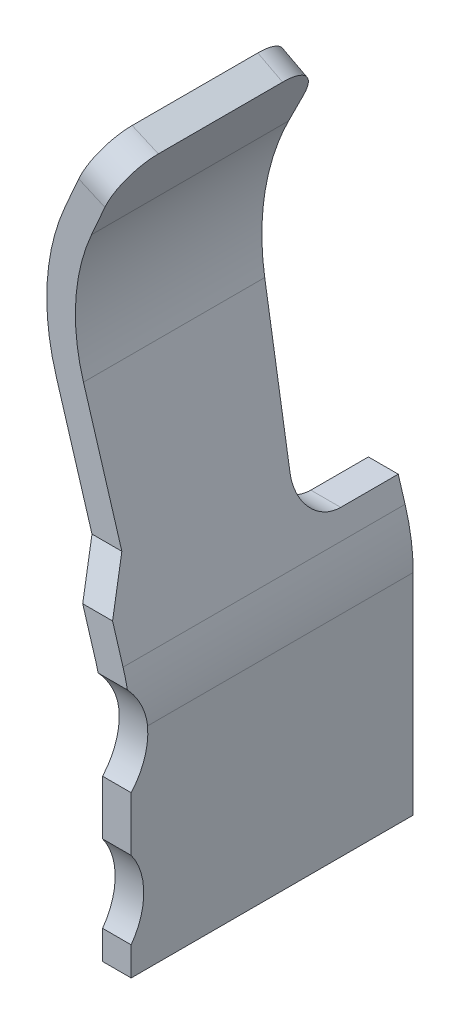
ISO-10303-21;
HEADER;
FILE_DESCRIPTION(('STEP AP214'),'2;1');
FILE_NAME('part.step','',(''),(''),'','','');
FILE_SCHEMA(('AUTOMOTIVE_DESIGN { 1 0 10303 214 1 1 1 1 }'));
ENDSEC;
DATA;
#1=APPLICATION_CONTEXT('core data for automotive mechanical design processes');
#2=APPLICATION_PROTOCOL_DEFINITION('international standard','automotive_design',2000,#1);
#3=PRODUCT_CONTEXT('',#1,'mechanical');
#4=PRODUCT('Part','Part','',(#3));
#5=PRODUCT_RELATED_PRODUCT_CATEGORY('part','',(#4));
#6=PRODUCT_DEFINITION_FORMATION('','',#4);
#7=PRODUCT_DEFINITION_CONTEXT('part definition',#1,'design');
#8=PRODUCT_DEFINITION('design','',#6,#7);
#9=PRODUCT_DEFINITION_SHAPE('','',#8);
#10=(LENGTH_UNIT() NAMED_UNIT(*) SI_UNIT(.MILLI.,.METRE.));
#11=(NAMED_UNIT(*) PLANE_ANGLE_UNIT() SI_UNIT($,.RADIAN.));
#12=(NAMED_UNIT(*) SI_UNIT($,.STERADIAN.) SOLID_ANGLE_UNIT());
#13=UNCERTAINTY_MEASURE_WITH_UNIT(LENGTH_MEASURE(1.E-05),#10,'distance_accuracy_value','');
#14=(GEOMETRIC_REPRESENTATION_CONTEXT(3) GLOBAL_UNCERTAINTY_ASSIGNED_CONTEXT((#13)) GLOBAL_UNIT_ASSIGNED_CONTEXT((#10,
#11,#12)) REPRESENTATION_CONTEXT('',''));
#15=CARTESIAN_POINT('',(0.,0.,0.));
#16=DIRECTION('',(0.,0.,1.));
#17=DIRECTION('',(1.,0.,0.));
#18=AXIS2_PLACEMENT_3D('',#15,#16,#17);
#19=CARTESIAN_POINT('',(14.5784449331811,3.52330708865174,0.423604352914839));
#20=DIRECTION('',(0.915327071470026,-0.402711251685505,0.));
#21=DIRECTION('',(0.402711251685505,0.915327071470026,0.));
#22=AXIS2_PLACEMENT_3D('',#19,#20,#21);
#23=CYLINDRICAL_SURFACE('',#22,0.2);
#24=CARTESIAN_POINT('',(14.5784449331811,3.52330708865174,0.423604352914839));
#25=DIRECTION('',(-0.915327071470029,0.402711251685498,0.));
#26=DIRECTION('',(0.402711251685498,0.915327071470029,0.));
#27=AXIS2_PLACEMENT_3D('',#24,#25,#26);
#28=CIRCLE('',#27,0.2);
#29=CARTESIAN_POINT('',(14.5784449331811,3.52330708865174,0.623604352914839));
#30=VERTEX_POINT('',#29);
#31=CARTESIAN_POINT('',(14.6589871835182,3.70637250294574,0.423604352914839));
#32=VERTEX_POINT('',#31);
#33=EDGE_CURVE('E312',#30,#32,#28,.T.);
#34=ORIENTED_EDGE('',*,*,#33,.F.);
#35=DIRECTION('',(-0.915327071470027,0.402711251685503,0.));
#36=VECTOR('',#35,1.);
#37=CARTESIAN_POINT('',(-10.0315059297135,14.3508073613119,0.623604352914805));
#38=LINE('',#37,#36);
#39=CARTESIAN_POINT('',(14.7157439939016,3.46290040089891,0.623604352914839));
#40=VERTEX_POINT('',#39);
#41=EDGE_CURVE('E27',#40,#30,#38,.T.);
#42=ORIENTED_EDGE('',*,*,#41,.F.);
#43=CARTESIAN_POINT('',(14.7157439939016,3.46290040089891,0.423604352914839));
#44=DIRECTION('',(0.915327071470029,-0.402711251685498,0.));
#45=DIRECTION('',(-0.402711251685498,-0.915327071470029,0.));
#46=AXIS2_PLACEMENT_3D('',#43,#44,#45);
#47=CIRCLE('',#46,0.2);
#48=CARTESIAN_POINT('',(14.7962862442387,3.64596581519291,0.423604352914839));
#49=VERTEX_POINT('',#48);
#50=EDGE_CURVE('E512',#49,#40,#47,.T.);
#51=ORIENTED_EDGE('',*,*,#50,.F.);
#52=DIRECTION('',(0.915327071470027,-0.402711251685503,0.));
#53=VECTOR('',#52,1.);
#54=CARTESIAN_POINT('',(14.6589871835182,3.70637250294574,0.423604352914839));
#55=LINE('',#54,#53);
#56=EDGE_CURVE('E340',#32,#49,#55,.T.);
#57=ORIENTED_EDGE('',*,*,#56,.F.);
#58=EDGE_LOOP('',(#34,#42,#51,#57));
#59=FACE_BOUND('',#58,.T.);
#60=ADVANCED_FACE('F16',(#59),#23,.T.);
#61=CARTESIAN_POINT('',(14.55613725867,3.53312166947706,-0.236832722369337));
#62=DIRECTION('',(-0.914255270392897,0.402239697454475,-0.0483789866630451));
#63=DIRECTION('',(-0.402711251685505,-0.915327071470026,0.));
#64=AXIS2_PLACEMENT_3D('',#61,#62,#63);
#65=CYLINDRICAL_SURFACE('',#64,0.2);
#66=CARTESIAN_POINT('',(14.7069405380458,3.44289092405021,-0.427421697659668));
#67=CARTESIAN_POINT('',(14.7580174651924,3.55898426375477,-0.441384710680955));
#68=CARTESIAN_POINT('',(14.7962862442387,3.64596581519291,-0.356133634256614));
#69=CARTESIAN_POINT('',(14.7962862442387,3.64596581519291,-0.228386927890316));
#70=(BOUNDED_CURVE() B_SPLINE_CURVE(3,(#66,#67,#68,#69),.UNSPECIFIED.,.F.,
.F.) B_SPLINE_CURVE_WITH_KNOTS((4,4),(6.17366415670651,7.85398163397443),
.UNSPECIFIED.) CURVE() GEOMETRIC_REPRESENTATION_ITEM() RATIONAL_B_SPLINE_CURVE((1.,
0.778229742533869,0.778229742533869,1.)) REPRESENTATION_ITEM(''));
#71=CARTESIAN_POINT('',(14.7069405380458,3.44289092405021,-0.427421697659668));
#72=VERTEX_POINT('',#71);
#73=CARTESIAN_POINT('',(14.7962862442387,3.64596581519291,-0.228386927890316));
#74=VERTEX_POINT('',#73);
#75=EDGE_CURVE('E339',#72,#74,#70,.T.);
#76=ORIENTED_EDGE('',*,*,#75,.F.);
#77=DIRECTION('',(0.914255270392898,-0.402239697454473,0.0483789866630451));
#78=VECTOR('',#77,1.);
#79=CARTESIAN_POINT('',(-10.631852655037,14.5910558161891,-1.76825633941021));
#80=LINE('',#79,#78);
#81=CARTESIAN_POINT('',(14.5696414773253,3.50329761180303,-0.434687053017796));
#82=VERTEX_POINT('',#81);
#83=EDGE_CURVE('E11',#82,#72,#80,.T.);
#84=ORIENTED_EDGE('',*,*,#83,.F.);
#85=CARTESIAN_POINT('',(14.6589871835182,3.70637250294574,-0.235652283248443));
#86=CARTESIAN_POINT('',(14.6589871835182,3.70637250294574,-0.363398989614741));
#87=CARTESIAN_POINT('',(14.6207184044719,3.61939095150759,-0.448650066039082));
#88=CARTESIAN_POINT('',(14.5696414773253,3.50329761180303,-0.434687053017796));
#89=(BOUNDED_CURVE() B_SPLINE_CURVE(3,(#85,#86,#87,#88),.UNSPECIFIED.,.F.,
.F.) B_SPLINE_CURVE_WITH_KNOTS((4,4),(4.71238898038476,6.39270645765268),
.UNSPECIFIED.) CURVE() GEOMETRIC_REPRESENTATION_ITEM() RATIONAL_B_SPLINE_CURVE((1.,
0.778229742533871,0.778229742533871,1.)) REPRESENTATION_ITEM(''));
#90=CARTESIAN_POINT('',(14.6589871835182,3.70637250294574,-0.235652283248443));
#91=VERTEX_POINT('',#90);
#92=EDGE_CURVE('E542',#91,#82,#89,.T.);
#93=ORIENTED_EDGE('',*,*,#92,.F.);
#94=DIRECTION('',(-0.914255270392898,0.402239697454473,-0.0483789866630451));
#95=VECTOR('',#94,1.);
#96=CARTESIAN_POINT('',(14.6366795090071,3.71618708377106,-0.236832722369337));
#97=LINE('',#96,#95);
#98=EDGE_CURVE('E526',#74,#91,#97,.T.);
#99=ORIENTED_EDGE('',*,*,#98,.F.);
#100=EDGE_LOOP('',(#76,#84,#93,#99));
#101=FACE_BOUND('',#100,.T.);
#102=ADVANCED_FACE('F395',(#101),#65,.T.);
#103=CARTESIAN_POINT('',(-15.49,1.65634067151207,-0.212546111318104));
#104=DIRECTION('',(0.,-1.,0.));
#105=DIRECTION('',(0.,0.,-1.));
#106=AXIS2_PLACEMENT_3D('',#103,#104,#105);
#107=PLANE('',#106);
#108=DIRECTION('',(0.,0.,-1.));
#109=VECTOR('',#108,1.);
#110=CARTESIAN_POINT('',(14.7348350789415,1.65634067151207,-0.740000000000018));
#111=LINE('',#110,#109);
#112=CARTESIAN_POINT('',(14.7348350789415,1.65634067151207,-0.438042305987952));
#113=VERTEX_POINT('',#112);
#114=CARTESIAN_POINT('',(14.7348350789415,1.65634067151207,-0.740000000000018));
#115=VERTEX_POINT('',#114);
#116=EDGE_CURVE('E492',#113,#115,#111,.T.);
#117=ORIENTED_EDGE('',*,*,#116,.F.);
#118=DIRECTION('',(1.,0.,0.));
#119=VECTOR('',#118,1.);
#120=CARTESIAN_POINT('',(14.8915034091056,1.65634067151207,-0.438042305987951));
#121=LINE('',#120,#119);
#122=CARTESIAN_POINT('',(14.8915034091056,1.65634067151207,-0.438042305987951));
#123=VERTEX_POINT('',#122);
#124=EDGE_CURVE('E288',#113,#123,#121,.T.);
#125=ORIENTED_EDGE('',*,*,#124,.T.);
#126=DIRECTION('',(0.,0.,1.));
#127=VECTOR('',#126,1.);
#128=CARTESIAN_POINT('',(14.8915034091056,1.65634067151207,-0.740000000000018));
#129=LINE('',#128,#127);
#130=CARTESIAN_POINT('',(14.8915034091056,1.65634067151207,-0.740000000000018));
#131=VERTEX_POINT('',#130);
#132=EDGE_CURVE('E267',#131,#123,#129,.T.);
#133=ORIENTED_EDGE('',*,*,#132,.F.);
#134=DIRECTION('',(-1.,0.,0.));
#135=VECTOR('',#134,1.);
#136=CARTESIAN_POINT('',(13.97,1.65634067151207,-0.740000000000019));
#137=LINE('',#136,#135);
#138=EDGE_CURVE('E615',#131,#115,#137,.T.);
#139=ORIENTED_EDGE('',*,*,#138,.T.);
#140=EDGE_LOOP('',(#117,#125,#133,#139));
#141=FACE_BOUND('',#140,.T.);
#142=ADVANCED_FACE('F400',(#141),#107,.F.);
#143=CARTESIAN_POINT('',(-15.49,3.70637250294571,-0.459111687165995));
#144=DIRECTION('',(0.,0.119413416546905,0.992844618230162));
#145=DIRECTION('',(1.,0.,0.));
#146=AXIS2_PLACEMENT_3D('',#143,#144,#145);
#147=PLANE('',#146);
#148=DIRECTION('',(-0.28674853992682,0.951150986717314,-0.11439875574724));
#149=VECTOR('',#148,1.);
#150=CARTESIAN_POINT('',(14.9096639548885,1.59610175610151,-0.205300934614502));
#151=LINE('',#150,#149);
#152=CARTESIAN_POINT('',(14.8240083074336,1.88022335482146,-0.239473382341919));
#153=VERTEX_POINT('',#152);
#154=CARTESIAN_POINT('',(14.6034137359037,2.61194022573825,-0.327479914176621));
#155=VERTEX_POINT('',#154);
#156=EDGE_CURVE('E112',#153,#155,#151,.T.);
#157=ORIENTED_EDGE('',*,*,#156,.F.);
#158=DIRECTION('',(-1.,0.,0.));
#159=VECTOR('',#158,1.);
#160=CARTESIAN_POINT('',(14.7348350789415,1.88022335482146,-0.23947338234192));
#161=LINE('',#160,#159);
#162=CARTESIAN_POINT('',(14.6673399772696,1.88022335482146,-0.23947338234192));
#163=VERTEX_POINT('',#162);
#164=EDGE_CURVE('E260',#153,#163,#161,.T.);
#165=ORIENTED_EDGE('',*,*,#164,.T.);
#166=DIRECTION('',(0.286748539926818,-0.951150986717315,0.11439875574724));
#167=VECTOR('',#166,1.);
#168=CARTESIAN_POINT('',(14.7658776351119,1.55337185451571,-0.200161637444145));
#169=LINE('',#168,#167);
#170=CARTESIAN_POINT('',(14.4597982395462,2.56864369924933,-0.322272466749579));
#171=VERTEX_POINT('',#170);
#172=EDGE_CURVE('E490',#171,#163,#169,.T.);
#173=ORIENTED_EDGE('',*,*,#172,.F.);
#174=CARTESIAN_POINT('',(14.5082242460961,3.36370167510267,-0.417897288102545));
#175=CARTESIAN_POINT('',(14.3966992050933,3.11021511680704,-0.387409439934768));
#176=CARTESIAN_POINT('',(14.379862605404,2.83379189253285,-0.354162906673266));
#177=CARTESIAN_POINT('',(14.4597982395462,2.56864369924933,-0.322272466749579));
#178=(BOUNDED_CURVE() B_SPLINE_CURVE(3,(#174,#175,#176,#177),.UNSPECIFIED.,.F.,
.F.) B_SPLINE_CURVE_WITH_KNOTS((4,4),(4.29791199977039,5.00519872138853),
.UNSPECIFIED.) CURVE() GEOMETRIC_REPRESENTATION_ITEM() RATIONAL_B_SPLINE_CURVE((1.,
0.958744787021091,0.958744787021091,1.)) REPRESENTATION_ITEM(''));
#179=CARTESIAN_POINT('',(14.5082242460961,3.36370167510267,-0.417897288102545));
#180=VERTEX_POINT('',#179);
#181=EDGE_CURVE('E293',#180,#171,#178,.T.);
#182=ORIENTED_EDGE('',*,*,#181,.F.);
#183=DIRECTION('',(-0.400292818236851,-0.909830186054405,0.109428936813832));
#184=VECTOR('',#183,1.);
#185=CARTESIAN_POINT('',(14.5223335100882,3.39577078475993,-0.421754368938234));
#186=LINE('',#185,#184);
#187=EDGE_CURVE('E539',#82,#180,#186,.T.);
#188=ORIENTED_EDGE('',*,*,#187,.F.);
#189=ORIENTED_EDGE('',*,*,#83,.T.);
#190=DIRECTION('',(0.400292818236852,0.909830186054405,-0.109428936813832));
#191=VECTOR('',#190,1.);
#192=CARTESIAN_POINT('',(14.6599508196559,3.33608744850051,-0.414576013974332));
#193=LINE('',#192,#191);
#194=CARTESIAN_POINT('',(14.6455233068166,3.30329498734983,-0.410631932744417));
#195=VERTEX_POINT('',#194);
#196=EDGE_CURVE('E332',#195,#72,#193,.T.);
#197=ORIENTED_EDGE('',*,*,#196,.F.);
#198=CARTESIAN_POINT('',(14.6034137359037,2.61194022573825,-0.327479914176621));
#199=CARTESIAN_POINT('',(14.5339044888234,2.84250387207174,-0.355210731501565));
#200=CARTESIAN_POINT('',(14.5485450102924,3.08287189317973,-0.384120760424611));
#201=CARTESIAN_POINT('',(14.6455233068166,3.30329498734983,-0.410631932744417));
#202=(BOUNDED_CURVE() B_SPLINE_CURVE(3,(#198,#199,#200,#201),.UNSPECIFIED.,.F.,
.F.) B_SPLINE_CURVE_WITH_KNOTS((4,4),(1.27798658579106,1.98527330740919),
.UNSPECIFIED.) CURVE() GEOMETRIC_REPRESENTATION_ITEM() RATIONAL_B_SPLINE_CURVE((1.,
0.958744787021091,0.958744787021091,1.)) REPRESENTATION_ITEM(''));
#203=EDGE_CURVE('E263',#155,#195,#202,.T.);
#204=ORIENTED_EDGE('',*,*,#203,.F.);
#205=EDGE_LOOP('',(#157,#165,#173,#182,#188,#189,#197,#204));
#206=FACE_BOUND('',#205,.T.);
#207=ADVANCED_FACE('F258',(#206),#147,.F.);
#208=CARTESIAN_POINT('',(-15.49,1.94413292378283,0.623604352914797));
#209=DIRECTION('',(0.,0.,-1.));
#210=DIRECTION('',(0.,-1.,0.));
#211=AXIS2_PLACEMENT_3D('',#208,#209,#210);
#212=PLANE('',#211);
#213=DIRECTION('',(-0.402711251685501,-0.915327071470028,0.));
#214=VECTOR('',#213,1.);
#215=CARTESIAN_POINT('',(14.6455233068166,3.30329498734984,0.623604352914839));
#216=LINE('',#215,#214);
#217=CARTESIAN_POINT('',(14.6455233068166,3.30329498734984,0.623604352914839));
#218=VERTEX_POINT('',#217);
#219=EDGE_CURVE('E507',#40,#218,#216,.T.);
#220=ORIENTED_EDGE('',*,*,#219,.F.);
#221=ORIENTED_EDGE('',*,*,#41,.T.);
#222=DIRECTION('',(0.4027112516855,0.915327071470028,0.));
#223=VECTOR('',#222,1.);
#224=CARTESIAN_POINT('',(14.5082242460961,3.36370167510267,0.623604352914839));
#225=LINE('',#224,#223);
#226=CARTESIAN_POINT('',(14.5082242460961,3.36370167510267,0.623604352914839));
#227=VERTEX_POINT('',#226);
#228=EDGE_CURVE('E317',#227,#30,#225,.T.);
#229=ORIENTED_EDGE('',*,*,#228,.F.);
#230=CARTESIAN_POINT('',(15.5608503782866,2.90058373566433,0.62360435291484));
#231=DIRECTION('',(0.,0.,-1.));
#232=DIRECTION('',(-1.,0.,0.));
#233=AXIS2_PLACEMENT_3D('',#230,#231,#232);
#234=CIRCLE('',#233,1.15);
#235=CARTESIAN_POINT('',(14.4597982395462,2.56864369924933,0.623604352914839));
#236=VERTEX_POINT('',#235);
#237=EDGE_CURVE('E562',#236,#227,#234,.T.);
#238=ORIENTED_EDGE('',*,*,#237,.F.);
#239=DIRECTION('',(-0.288643509926088,0.957436642382956,0.));
#240=VECTOR('',#239,1.);
#241=CARTESIAN_POINT('',(14.7838211460255,1.49385284836845,0.623604352914839));
#242=LINE('',#241,#240);
#243=CARTESIAN_POINT('',(14.6480728200643,1.94413292378283,0.623604352914839));
#244=VERTEX_POINT('',#243);
#245=EDGE_CURVE('E587',#244,#236,#242,.T.);
#246=ORIENTED_EDGE('',*,*,#245,.F.);
#247=DIRECTION('',(1.,0.,0.));
#248=VECTOR('',#247,1.);
#249=CARTESIAN_POINT('',(-15.49,1.94413292378283,0.623604352914797));
#250=LINE('',#249,#248);
#251=CARTESIAN_POINT('',(14.8047411502284,1.94413292378283,0.623604352914839));
#252=VERTEX_POINT('',#251);
#253=EDGE_CURVE('E325',#244,#252,#250,.T.);
#254=ORIENTED_EDGE('',*,*,#253,.T.);
#255=DIRECTION('',(0.28864350992609,-0.957436642382956,0.));
#256=VECTOR('',#255,1.);
#257=CARTESIAN_POINT('',(14.927436642383,1.53714937485737,0.623604352914839));
#258=LINE('',#257,#256);
#259=CARTESIAN_POINT('',(14.6034137359037,2.61194022573825,0.623604352914839));
#260=VERTEX_POINT('',#259);
#261=EDGE_CURVE('E266',#260,#252,#258,.T.);
#262=ORIENTED_EDGE('',*,*,#261,.F.);
#263=CARTESIAN_POINT('',(15.5608503782866,2.90058373566433,0.62360435291484));
#264=DIRECTION('',(0.,0.,1.));
#265=DIRECTION('',(-1.,0.,0.));
#266=AXIS2_PLACEMENT_3D('',#263,#264,#265);
#267=CIRCLE('',#266,1.);
#268=EDGE_CURVE('E126',#218,#260,#267,.T.);
#269=ORIENTED_EDGE('',*,*,#268,.F.);
#270=EDGE_LOOP('',(#220,#221,#229,#238,#246,#254,#262,#269));
#271=FACE_BOUND('',#270,.T.);
#272=ADVANCED_FACE('F416',(#271),#212,.F.);
#273=CARTESIAN_POINT('',(-15.49,1.7003498353216,0.749999999999972));
#274=DIRECTION('',(0.,-0.460287319631494,-0.887770005906065));
#275=DIRECTION('',(0.,-0.887770005906065,0.460287319631494));
#276=AXIS2_PLACEMENT_3D('',#273,#274,#275);
#277=PLANE('',#276);
#278=DIRECTION('',(-1.,0.,0.));
#279=VECTOR('',#278,1.);
#280=CARTESIAN_POINT('',(13.97,1.7196371362757,0.739999999999981));
#281=LINE('',#280,#279);
#282=CARTESIAN_POINT('',(14.8724210876793,1.7196371362757,0.739999999999982));
#283=VERTEX_POINT('',#282);
#284=CARTESIAN_POINT('',(14.7157527575152,1.7196371362757,0.739999999999982));
#285=VERTEX_POINT('',#284);
#286=EDGE_CURVE('E498',#283,#285,#281,.T.);
#287=ORIENTED_EDGE('',*,*,#286,.F.);
#288=DIRECTION('',(0.258541028225372,-0.857586072334425,0.444637678635293));
#289=VECTOR('',#288,1.);
#290=CARTESIAN_POINT('',(14.7464234383064,2.13757401070795,0.523309818502748));
#291=LINE('',#290,#289);
#292=EDGE_CURVE('E85',#252,#283,#291,.T.);
#293=ORIENTED_EDGE('',*,*,#292,.F.);
#294=ORIENTED_EDGE('',*,*,#253,.F.);
#295=DIRECTION('',(-0.258541028225371,0.857586072334425,-0.444637678635293));
#296=VECTOR('',#295,1.);
#297=CARTESIAN_POINT('',(14.6002273619162,2.10283732290249,0.541319952677684));
#298=LINE('',#297,#296);
#299=EDGE_CURVE('E561',#285,#244,#298,.T.);
#300=ORIENTED_EDGE('',*,*,#299,.F.);
#301=EDGE_LOOP('',(#287,#293,#294,#300));
#302=FACE_BOUND('',#301,.T.);
#303=ADVANCED_FACE('F391',(#302),#277,.F.);
#304=CARTESIAN_POINT('',(13.97,1.24850586493128,0.739999999999981));
#305=DIRECTION('',(0.,0.,-1.));
#306=DIRECTION('',(0.,-1.,0.));
#307=AXIS2_PLACEMENT_3D('',#304,#305,#306);
#308=PLANE('',#307);
#309=DIRECTION('',(0.,-1.,0.));
#310=VECTOR('',#309,1.);
#311=CARTESIAN_POINT('',(14.97,0.145965815192914,0.739999999999982));
#312=LINE('',#311,#310);
#313=CARTESIAN_POINT('',(14.97,0.296740599868486,0.739999999999982));
#314=VERTEX_POINT('',#313);
#315=CARTESIAN_POINT('',(14.97,0.145965815192914,0.739999999999982));
#316=VERTEX_POINT('',#315);
#317=EDGE_CURVE('E515',#314,#316,#312,.T.);
#318=ORIENTED_EDGE('',*,*,#317,.F.);
#319=DIRECTION('',(-1.,0.,0.));
#320=VECTOR('',#319,1.);
#321=CARTESIAN_POINT('',(-15.49,0.296740599868486,0.73999999999994));
#322=LINE('',#321,#320);
#323=CARTESIAN_POINT('',(14.82,0.296740599868486,0.739999999999982));
#324=VERTEX_POINT('',#323);
#325=EDGE_CURVE('E532',#314,#324,#322,.T.);
#326=ORIENTED_EDGE('',*,*,#325,.T.);
#327=DIRECTION('',(0.,1.,0.));
#328=VECTOR('',#327,1.);
#329=CARTESIAN_POINT('',(14.82,0.145965815192914,0.739999999999982));
#330=LINE('',#329,#328);
#331=CARTESIAN_POINT('',(14.82,0.145965815192914,0.739999999999982));
#332=VERTEX_POINT('',#331);
#333=EDGE_CURVE('E301',#332,#324,#330,.T.);
#334=ORIENTED_EDGE('',*,*,#333,.F.);
#335=DIRECTION('',(-1.,0.,0.));
#336=VECTOR('',#335,1.);
#337=CARTESIAN_POINT('',(14.82,0.145965815192914,0.739999999999982));
#338=LINE('',#337,#336);
#339=EDGE_CURVE('E311',#316,#332,#338,.T.);
#340=ORIENTED_EDGE('',*,*,#339,.F.);
#341=EDGE_LOOP('',(#318,#326,#334,#340));
#342=FACE_BOUND('',#341,.T.);
#343=ADVANCED_FACE('F383',(#342),#308,.F.);
#344=CARTESIAN_POINT('',(13.97,1.24850586493128,-0.740000000000019));
#345=DIRECTION('',(0.,0.,-1.));
#346=DIRECTION('',(0.,-1.,0.));
#347=AXIS2_PLACEMENT_3D('',#344,#345,#346);
#348=PLANE('',#347);
#349=ORIENTED_EDGE('',*,*,#138,.F.);
#350=DIRECTION('',(0.28864350992609,-0.957436642382956,0.));
#351=VECTOR('',#350,1.);
#352=CARTESIAN_POINT('',(14.927436642383,1.53714937485737,-0.740000000000018));
#353=LINE('',#352,#351);
#354=CARTESIAN_POINT('',(14.927436642383,1.53714937485737,-0.740000000000018));
#355=VERTEX_POINT('',#354);
#356=EDGE_CURVE('E320',#131,#355,#353,.T.);
#357=ORIENTED_EDGE('',*,*,#356,.T.);
#358=CARTESIAN_POINT('',(13.97,1.24850586493128,-0.740000000000019));
#359=DIRECTION('',(0.,0.,-1.));
#360=DIRECTION('',(-1.,0.,0.));
#361=AXIS2_PLACEMENT_3D('',#358,#359,#360);
#362=CIRCLE('',#361,1.);
#363=CARTESIAN_POINT('',(14.97,1.24850586493128,-0.740000000000018));
#364=VERTEX_POINT('',#363);
#365=EDGE_CURVE('E459',#355,#364,#362,.T.);
#366=ORIENTED_EDGE('',*,*,#365,.T.);
#367=DIRECTION('',(0.,-1.,0.));
#368=VECTOR('',#367,1.);
#369=CARTESIAN_POINT('',(14.97,0.145965815192914,-0.740000000000018));
#370=LINE('',#369,#368);
#371=CARTESIAN_POINT('',(14.97,0.145965815192914,-0.740000000000018));
#372=VERTEX_POINT('',#371);
#373=EDGE_CURVE('E42',#364,#372,#370,.T.);
#374=ORIENTED_EDGE('',*,*,#373,.T.);
#375=DIRECTION('',(-1.,0.,0.));
#376=VECTOR('',#375,1.);
#377=CARTESIAN_POINT('',(14.82,0.145965815192914,-0.740000000000018));
#378=LINE('',#377,#376);
#379=CARTESIAN_POINT('',(14.82,0.145965815192914,-0.740000000000018));
#380=VERTEX_POINT('',#379);
#381=EDGE_CURVE('E310',#372,#380,#378,.T.);
#382=ORIENTED_EDGE('',*,*,#381,.T.);
#383=DIRECTION('',(0.,1.,0.));
#384=VECTOR('',#383,1.);
#385=CARTESIAN_POINT('',(14.82,0.145965815192914,-0.740000000000018));
#386=LINE('',#385,#384);
#387=CARTESIAN_POINT('',(14.82,1.24850586493128,-0.740000000000018));
#388=VERTEX_POINT('',#387);
#389=EDGE_CURVE('E304',#380,#388,#386,.T.);
#390=ORIENTED_EDGE('',*,*,#389,.T.);
#391=CARTESIAN_POINT('',(13.97,1.24850586493128,-0.740000000000019));
#392=DIRECTION('',(0.,0.,1.));
#393=DIRECTION('',(-1.,0.,0.));
#394=AXIS2_PLACEMENT_3D('',#391,#392,#393);
#395=CIRCLE('',#394,0.85);
#396=CARTESIAN_POINT('',(14.7838211460255,1.49385284836845,-0.740000000000018));
#397=VERTEX_POINT('',#396);
#398=EDGE_CURVE('E493',#388,#397,#395,.T.);
#399=ORIENTED_EDGE('',*,*,#398,.T.);
#400=DIRECTION('',(-0.288643509926088,0.957436642382956,0.));
#401=VECTOR('',#400,1.);
#402=CARTESIAN_POINT('',(14.7838211460255,1.49385284836845,-0.740000000000018));
#403=LINE('',#402,#401);
#404=EDGE_CURVE('E538',#397,#115,#403,.T.);
#405=ORIENTED_EDGE('',*,*,#404,.T.);
#406=EDGE_LOOP('',(#349,#357,#366,#374,#382,#390,#399,#405));
#407=FACE_BOUND('',#406,.T.);
#408=ADVANCED_FACE('F380',(#407),#348,.T.);
#409=CARTESIAN_POINT('',(14.97,0.145965815192914,-0.740000000000018));
#410=DIRECTION('',(-1.,0.,0.));
#411=DIRECTION('',(0.,0.,1.));
#412=AXIS2_PLACEMENT_3D('',#409,#410,#411);
#413=PLANE('',#412);
#414=DIRECTION('',(0.,0.,1.));
#415=VECTOR('',#414,1.);
#416=CARTESIAN_POINT('',(14.97,1.24850586493128,-0.740000000000018));
#417=LINE('',#416,#415);
#418=CARTESIAN_POINT('',(14.97,1.24850586493128,0.654029100989327));
#419=VERTEX_POINT('',#418);
#420=EDGE_CURVE('E456',#364,#419,#417,.T.);
#421=ORIENTED_EDGE('',*,*,#420,.T.);
#422=CARTESIAN_POINT('',(14.97,1.21669179396546,0.995153761033099));
#423=DIRECTION('',(1.,0.,0.));
#424=DIRECTION('',(0.,0.,1.));
#425=AXIS2_PLACEMENT_3D('',#422,#423,#424);
#426=CIRCLE('',#425,0.342604974863759);
#427=CARTESIAN_POINT('',(14.97,0.988055123608201,0.739999999999982));
#428=VERTEX_POINT('',#427);
#429=EDGE_CURVE('E461',#428,#419,#426,.T.);
#430=ORIENTED_EDGE('',*,*,#429,.F.);
#431=DIRECTION('',(0.,-1.,0.));
#432=VECTOR('',#431,1.);
#433=CARTESIAN_POINT('',(14.97,0.145965815192914,0.739999999999982));
#434=LINE('',#433,#432);
#435=CARTESIAN_POINT('',(14.97,0.703259400131467,0.739999999999982));
#436=VERTEX_POINT('',#435);
#437=EDGE_CURVE('E452',#428,#436,#434,.T.);
#438=ORIENTED_EDGE('',*,*,#437,.T.);
#439=CARTESIAN_POINT('',(14.97,0.499999999999977,1.01942683457021));
#440=DIRECTION('',(1.,0.,0.));
#441=DIRECTION('',(0.,0.,1.));
#442=AXIS2_PLACEMENT_3D('',#439,#440,#441);
#443=CIRCLE('',#442,0.345533991988848);
#444=EDGE_CURVE('E527',#314,#436,#443,.T.);
#445=ORIENTED_EDGE('',*,*,#444,.F.);
#446=ORIENTED_EDGE('',*,*,#317,.T.);
#447=DIRECTION('',(0.,0.,1.));
#448=VECTOR('',#447,1.);
#449=CARTESIAN_POINT('',(14.97,0.145965815192914,-0.740000000000018));
#450=LINE('',#449,#448);
#451=EDGE_CURVE('E519',#372,#316,#450,.T.);
#452=ORIENTED_EDGE('',*,*,#451,.F.);
#453=ORIENTED_EDGE('',*,*,#373,.F.);
#454=EDGE_LOOP('',(#421,#430,#438,#445,#446,#452,#453));
#455=FACE_BOUND('',#454,.T.);
#456=ADVANCED_FACE('F382',(#455),#413,.F.);
#457=CARTESIAN_POINT('',(13.97,1.24850586493128,-0.740000000000019));
#458=DIRECTION('',(0.,0.,1.));
#459=DIRECTION('',(1.,0.,0.));
#460=AXIS2_PLACEMENT_3D('',#457,#458,#459);
#461=CYLINDRICAL_SURFACE('',#460,1.);
#462=CARTESIAN_POINT('',(13.97,1.24850586493128,0.739999999999981));
#463=DIRECTION('',(0.,0.,-1.));
#464=DIRECTION('',(-1.,0.,0.));
#465=AXIS2_PLACEMENT_3D('',#462,#463,#464);
#466=CIRCLE('',#465,1.);
#467=CARTESIAN_POINT('',(14.927436642383,1.53714937485737,0.739999999999982));
#468=VERTEX_POINT('',#467);
#469=CARTESIAN_POINT('',(14.9504391181347,1.44532846432271,0.739999999999982));
#470=VERTEX_POINT('',#469);
#471=EDGE_CURVE('E444',#468,#470,#466,.T.);
#472=ORIENTED_EDGE('',*,*,#471,.T.);
#473=CARTESIAN_POINT('',(14.9504391181347,1.44532846432271,0.739999999999982));
#474=CARTESIAN_POINT('',(14.9511213174168,1.44193024717423,0.73695469854555));
#475=CARTESIAN_POINT('',(14.9517972185085,1.43847176034276,0.73397504589978));
#476=CARTESIAN_POINT('',(14.953128559526,1.43145643098181,0.728168909340073));
#477=CARTESIAN_POINT('',(14.9537840893162,1.4279002110218,0.725341693612022));
#478=CARTESIAN_POINT('',(14.9550716881697,1.42068928784976,0.719840380711378));
#479=CARTESIAN_POINT('',(14.9557038382792,1.41703501951613,0.71716573280574));
#480=CARTESIAN_POINT('',(14.9569415721265,1.40962817005644,0.711969336935558));
#481=CARTESIAN_POINT('',(14.9575472155212,1.40587584366145,0.709447240162022));
#482=CARTESIAN_POINT('',(14.9587287712968,1.39827302810731,0.704555749407561));
#483=CARTESIAN_POINT('',(14.9593047088884,1.39442262647159,0.702186225502149));
#484=CARTESIAN_POINT('',(14.9604236172259,1.38662388081528,0.697599649617543));
#485=CARTESIAN_POINT('',(14.9609665658168,1.38267547342782,0.695382699976001));
#486=CARTESIAN_POINT('',(14.9620161960499,1.37468096295917,0.691101059928339));
#487=CARTESIAN_POINT('',(14.9625227957388,1.37063466501788,0.689036713287435));
#488=CARTESIAN_POINT('',(14.963496351594,1.36244473872746,0.685059955148981));
#489=CARTESIAN_POINT('',(14.963963154396,1.35830080604154,0.683148133100351));
#490=CARTESIAN_POINT('',(14.9648538510173,1.34991442649095,0.679475891500467));
#491=CARTESIAN_POINT('',(14.965277495071,1.3456715635434,0.67771636122218));
#492=CARTESIAN_POINT('',(14.9660735280579,1.33713872195245,0.674376033868799));
#493=CARTESIAN_POINT('',(14.966446189351,1.33284913740306,0.672794295796556));
#494=CARTESIAN_POINT('',(14.9671386385479,1.3242236254453,0.669809238507287));
#495=CARTESIAN_POINT('',(14.9674586341499,1.31988795555471,0.66840522372266));
#496=CARTESIAN_POINT('',(14.9680441441101,1.31117101253302,0.6657753824784));
#497=CARTESIAN_POINT('',(14.9683097914247,1.30678987892436,0.664549123358685));
#498=CARTESIAN_POINT('',(14.9687849936784,1.29798278695452,0.662274523841816));
#499=CARTESIAN_POINT('',(14.9689945979607,1.29355687160898,0.661226027233422));
#500=CARTESIAN_POINT('',(14.9693561122407,1.28466100981422,0.659306657193447));
#501=CARTESIAN_POINT('',(14.9695079805488,1.28019103393027,0.65843591232125));
#502=CARTESIAN_POINT('',(14.9697523915187,1.27120787033462,0.656871822149815));
#503=CARTESIAN_POINT('',(14.9698447957013,1.26669460642081,0.656178893183986));
#504=CARTESIAN_POINT('',(14.9699687563761,1.25762568522594,0.654969909316702));
#505=CARTESIAN_POINT('',(14.970000074122,1.25306993125343,0.654454554866678));
#506=CARTESIAN_POINT('',(14.97,1.24850586493128,0.654029100989326));
#507=B_SPLINE_CURVE_WITH_KNOTS('',3,(#473,#474,#475,#476,#477,#478,#479,#480,#481,#482,#483,
#484,#485,#486,#487,#488,#489,#490,#491,#492,#493,#494,#495,#496,#497,#498,#499,#500,#501,#502,
#503,#504,#505,#506),.UNSPECIFIED.,.F.,.F.,(4,2,2,2,2,2,2,2,2,2,2,2,2,2,2,2,4),(0.,
0.0138407212059899,0.0276076629967111,0.041321273515667,0.0550022400248735,0.0686713979825941,
0.0823496367916649,0.0960578043227363,0.109816612381089,0.123650992268865,0.137408310969428,
0.151110002599196,0.164777762982443,0.17843344966996,0.192098978145176,0.205796216649336,
0.219546882133366),.UNSPECIFIED.);
#508=EDGE_CURVE('E464',#470,#419,#507,.T.);
#509=ORIENTED_EDGE('',*,*,#508,.T.);
#510=ORIENTED_EDGE('',*,*,#420,.F.);
#511=ORIENTED_EDGE('',*,*,#365,.F.);
#512=DIRECTION('',(0.,0.,1.));
#513=VECTOR('',#512,1.);
#514=CARTESIAN_POINT('',(14.927436642383,1.53714937485737,-0.740000000000018));
#515=LINE('',#514,#513);
#516=EDGE_CURVE('E68',#355,#468,#515,.T.);
#517=ORIENTED_EDGE('',*,*,#516,.T.);
#518=EDGE_LOOP('',(#472,#509,#510,#511,#517));
#519=FACE_BOUND('',#518,.T.);
#520=ADVANCED_FACE('F365',(#519),#461,.T.);
#521=CARTESIAN_POINT('',(14.927436642383,1.53714937485737,-0.740000000000018));
#522=DIRECTION('',(-0.957436642382956,-0.28864350992609,0.));
#523=DIRECTION('',(-0.28864350992609,0.957436642382956,0.));
#524=AXIS2_PLACEMENT_3D('',#521,#522,#523);
#525=PLANE('',#524);
#526=ORIENTED_EDGE('',*,*,#356,.F.);
#527=ORIENTED_EDGE('',*,*,#132,.T.);
#528=CARTESIAN_POINT('',(14.8915034091056,1.65634067151207,-0.438042305987951));
#529=CARTESIAN_POINT('',(14.8915034091056,1.65634067151208,-0.320885018462571));
#530=CARTESIAN_POINT('',(14.8665283765635,1.73918338398669,-0.238042305987951));
#531=CARTESIAN_POINT('',(14.8312083468218,1.85634067151208,-0.238042305987952));
#532=(BOUNDED_CURVE() B_SPLINE_CURVE(3,(#528,#529,#530,#531),.UNSPECIFIED.,.F.,
.F.) B_SPLINE_CURVE_WITH_KNOTS((4,4),(3.1415926535898,4.71238898038469),
.UNSPECIFIED.) CURVE() GEOMETRIC_REPRESENTATION_ITEM() RATIONAL_B_SPLINE_CURVE((1.,
0.804737854124365,0.804737854124365,1.)) REPRESENTATION_ITEM(''));
#533=CARTESIAN_POINT('',(14.8312083468218,1.85634067151208,-0.238042305987952));
#534=VERTEX_POINT('',#533);
#535=EDGE_CURVE('E281',#123,#534,#532,.T.);
#536=ORIENTED_EDGE('',*,*,#535,.T.);
#537=CARTESIAN_POINT('',(14.8312083468218,1.85634067151208,-0.238042305987952));
#538=CARTESIAN_POINT('',(14.8288011555845,1.86432537588468,-0.238042305987952));
#539=CARTESIAN_POINT('',(14.8263982742986,1.87229578405696,-0.23851990151267));
#540=CARTESIAN_POINT('',(14.8240083074336,1.88022335482146,-0.239473382341919));
#541=(BOUNDED_CURVE() B_SPLINE_CURVE(3,(#537,#538,#539,#540),.UNSPECIFIED.,.F.,
.F.) B_SPLINE_CURVE_WITH_KNOTS((4,4),(4.71238898038469,4.83208803082147),
.UNSPECIFIED.) CURVE() GEOMETRIC_REPRESENTATION_ITEM() RATIONAL_B_SPLINE_CURVE((1.,
0.998806367803328,0.998806367803328,1.)) REPRESENTATION_ITEM(''));
#542=EDGE_CURVE('E273',#534,#153,#541,.T.);
#543=ORIENTED_EDGE('',*,*,#542,.T.);
#544=ORIENTED_EDGE('',*,*,#156,.T.);
#545=DIRECTION('',(0.,0.,1.));
#546=VECTOR('',#545,1.);
#547=CARTESIAN_POINT('',(14.6034137359037,2.61194022573825,-0.740000000000018));
#548=LINE('',#547,#546);
#549=EDGE_CURVE('E547',#155,#260,#548,.T.);
#550=ORIENTED_EDGE('',*,*,#549,.T.);
#551=ORIENTED_EDGE('',*,*,#261,.T.);
#552=ORIENTED_EDGE('',*,*,#292,.T.);
#553=DIRECTION('',(0.28864350992609,-0.957436642382956,0.));
#554=VECTOR('',#553,1.);
#555=CARTESIAN_POINT('',(14.927436642383,1.53714937485737,0.739999999999982));
#556=LINE('',#555,#554);
#557=EDGE_CURVE('E503',#283,#468,#556,.T.);
#558=ORIENTED_EDGE('',*,*,#557,.T.);
#559=ORIENTED_EDGE('',*,*,#516,.F.);
#560=EDGE_LOOP('',(#526,#527,#536,#543,#544,#550,#551,#552,#558,#559));
#561=FACE_BOUND('',#560,.T.);
#562=ADVANCED_FACE('F280',(#561),#525,.F.);
#563=CARTESIAN_POINT('',(15.5608503782866,2.90058373566433,-0.740000000000017));
#564=DIRECTION('',(0.,0.,1.));
#565=DIRECTION('',(1.,0.,0.));
#566=AXIS2_PLACEMENT_3D('',#563,#564,#565);
#567=CYLINDRICAL_SURFACE('',#566,1.);
#568=ORIENTED_EDGE('',*,*,#549,.F.);
#569=ORIENTED_EDGE('',*,*,#203,.T.);
#570=DIRECTION('',(0.,0.,1.));
#571=VECTOR('',#570,1.);
#572=CARTESIAN_POINT('',(14.6455233068166,3.30329498734983,-0.740000000000018));
#573=LINE('',#572,#571);
#574=EDGE_CURVE('E511',#195,#218,#573,.T.);
#575=ORIENTED_EDGE('',*,*,#574,.T.);
#576=ORIENTED_EDGE('',*,*,#268,.T.);
#577=EDGE_LOOP('',(#568,#569,#575,#576));
#578=FACE_BOUND('',#577,.T.);
#579=ADVANCED_FACE('F368',(#578),#567,.F.);
#580=CARTESIAN_POINT('',(14.6455233068166,3.30329498734984,-0.740000000000018));
#581=DIRECTION('',(-0.915327071470028,0.402711251685501,0.));
#582=DIRECTION('',(0.,0.,1.));
#583=AXIS2_PLACEMENT_3D('',#580,#581,#582);
#584=PLANE('',#583);
#585=ORIENTED_EDGE('',*,*,#196,.T.);
#586=ORIENTED_EDGE('',*,*,#75,.T.);
#587=DIRECTION('',(0.,0.,1.));
#588=VECTOR('',#587,1.);
#589=CARTESIAN_POINT('',(14.7962862442387,3.64596581519291,-0.740000000000018));
#590=LINE('',#589,#588);
#591=EDGE_CURVE('E316',#74,#49,#590,.T.);
#592=ORIENTED_EDGE('',*,*,#591,.T.);
#593=ORIENTED_EDGE('',*,*,#50,.T.);
#594=ORIENTED_EDGE('',*,*,#219,.T.);
#595=ORIENTED_EDGE('',*,*,#574,.F.);
#596=EDGE_LOOP('',(#585,#586,#592,#593,#594,#595));
#597=FACE_BOUND('',#596,.T.);
#598=ADVANCED_FACE('F371',(#597),#584,.F.);
#599=CARTESIAN_POINT('',(14.6589871835182,3.70637250294574,-0.740000000000018));
#600=DIRECTION('',(-0.402711251685503,-0.915327071470027,0.));
#601=DIRECTION('',(-0.915327071470027,0.402711251685503,0.));
#602=AXIS2_PLACEMENT_3D('',#599,#600,#601);
#603=PLANE('',#602);
#604=ORIENTED_EDGE('',*,*,#591,.F.);
#605=ORIENTED_EDGE('',*,*,#98,.T.);
#606=DIRECTION('',(0.,0.,1.));
#607=VECTOR('',#606,1.);
#608=CARTESIAN_POINT('',(14.6589871835182,3.70637250294574,-0.740000000000018));
#609=LINE('',#608,#607);
#610=EDGE_CURVE('E566',#91,#32,#609,.T.);
#611=ORIENTED_EDGE('',*,*,#610,.T.);
#612=ORIENTED_EDGE('',*,*,#56,.T.);
#613=EDGE_LOOP('',(#604,#605,#611,#612));
#614=FACE_BOUND('',#613,.T.);
#615=ADVANCED_FACE('F408',(#614),#603,.F.);
#616=CARTESIAN_POINT('',(14.5082242460961,3.36370167510267,-0.740000000000018));
#617=DIRECTION('',(0.915327071470028,-0.4027112516855,0.));
#618=DIRECTION('',(0.,0.,-1.));
#619=AXIS2_PLACEMENT_3D('',#616,#617,#618);
#620=PLANE('',#619);
#621=ORIENTED_EDGE('',*,*,#610,.F.);
#622=ORIENTED_EDGE('',*,*,#92,.T.);
#623=ORIENTED_EDGE('',*,*,#187,.T.);
#624=DIRECTION('',(0.,0.,1.));
#625=VECTOR('',#624,1.);
#626=CARTESIAN_POINT('',(14.5082242460961,3.36370167510267,-0.740000000000018));
#627=LINE('',#626,#625);
#628=EDGE_CURVE('E618',#180,#227,#627,.T.);
#629=ORIENTED_EDGE('',*,*,#628,.T.);
#630=ORIENTED_EDGE('',*,*,#228,.T.);
#631=ORIENTED_EDGE('',*,*,#33,.T.);
#632=EDGE_LOOP('',(#621,#622,#623,#629,#630,#631));
#633=FACE_BOUND('',#632,.T.);
#634=ADVANCED_FACE('F404',(#633),#620,.F.);
#635=CARTESIAN_POINT('',(15.5608503782866,2.90058373566433,-0.740000000000017));
#636=DIRECTION('',(0.,0.,1.));
#637=DIRECTION('',(1.,0.,0.));
#638=AXIS2_PLACEMENT_3D('',#635,#636,#637);
#639=CYLINDRICAL_SURFACE('',#638,1.15);
#640=ORIENTED_EDGE('',*,*,#628,.F.);
#641=ORIENTED_EDGE('',*,*,#181,.T.);
#642=DIRECTION('',(0.,0.,1.));
#643=VECTOR('',#642,1.);
#644=CARTESIAN_POINT('',(14.4597982395462,2.56864369924933,-0.740000000000019));
#645=LINE('',#644,#643);
#646=EDGE_CURVE('E591',#171,#236,#645,.T.);
#647=ORIENTED_EDGE('',*,*,#646,.T.);
#648=ORIENTED_EDGE('',*,*,#237,.T.);
#649=EDGE_LOOP('',(#640,#641,#647,#648));
#650=FACE_BOUND('',#649,.T.);
#651=ADVANCED_FACE('F407',(#650),#639,.T.);
#652=CARTESIAN_POINT('',(14.7838211460255,1.49385284836845,-0.740000000000018));
#653=DIRECTION('',(0.957436642382956,0.288643509926088,0.));
#654=DIRECTION('',(0.,0.,-1.));
#655=AXIS2_PLACEMENT_3D('',#652,#653,#654);
#656=PLANE('',#655);
#657=ORIENTED_EDGE('',*,*,#172,.T.);
#658=CARTESIAN_POINT('',(14.6673399772696,1.88022335482146,-0.23947338234192));
#659=CARTESIAN_POINT('',(14.6697299441346,1.87229578405696,-0.23851990151267));
#660=CARTESIAN_POINT('',(14.6721328254205,1.86432537588468,-0.238042305987952));
#661=CARTESIAN_POINT('',(14.6745400166578,1.85634067151208,-0.238042305987952));
#662=(BOUNDED_CURVE() B_SPLINE_CURVE(3,(#658,#659,#660,#661),.UNSPECIFIED.,.F.,
.F.) B_SPLINE_CURVE_WITH_KNOTS((4,4),(1.45109727635811,1.5707963267949),
.UNSPECIFIED.) CURVE() GEOMETRIC_REPRESENTATION_ITEM() RATIONAL_B_SPLINE_CURVE((1.,
0.998806367803328,0.998806367803328,1.)) REPRESENTATION_ITEM(''));
#663=CARTESIAN_POINT('',(14.6745400166578,1.85634067151208,-0.238042305987952));
#664=VERTEX_POINT('',#663);
#665=EDGE_CURVE('E275',#163,#664,#662,.T.);
#666=ORIENTED_EDGE('',*,*,#665,.T.);
#667=CARTESIAN_POINT('',(14.6745400166578,1.85634067151208,-0.238042305987952));
#668=CARTESIAN_POINT('',(14.7098600463995,1.73918338398669,-0.238042305987952));
#669=CARTESIAN_POINT('',(14.7348350789415,1.65634067151208,-0.320885018462571));
#670=CARTESIAN_POINT('',(14.7348350789415,1.65634067151207,-0.438042305987952));
#671=(BOUNDED_CURVE() B_SPLINE_CURVE(3,(#667,#668,#669,#670),.UNSPECIFIED.,.F.,
.F.) B_SPLINE_CURVE_WITH_KNOTS((4,4),(1.5707963267949,3.1415926535898),
.UNSPECIFIED.) CURVE() GEOMETRIC_REPRESENTATION_ITEM() RATIONAL_B_SPLINE_CURVE((1.,
0.804737854124365,0.804737854124365,1.)) REPRESENTATION_ITEM(''));
#672=EDGE_CURVE('E328',#664,#113,#671,.T.);
#673=ORIENTED_EDGE('',*,*,#672,.T.);
#674=ORIENTED_EDGE('',*,*,#116,.T.);
#675=ORIENTED_EDGE('',*,*,#404,.F.);
#676=DIRECTION('',(0.,0.,1.));
#677=VECTOR('',#676,1.);
#678=CARTESIAN_POINT('',(14.7838211460255,1.49385284836845,-0.740000000000018));
#679=LINE('',#678,#677);
#680=CARTESIAN_POINT('',(14.7838211460255,1.49385284836845,0.739999999999982));
#681=VERTEX_POINT('',#680);
#682=EDGE_CURVE('E303',#397,#681,#679,.T.);
#683=ORIENTED_EDGE('',*,*,#682,.T.);
#684=DIRECTION('',(-0.288643509926088,0.957436642382956,0.));
#685=VECTOR('',#684,1.);
#686=CARTESIAN_POINT('',(14.7838211460255,1.49385284836845,0.739999999999982));
#687=LINE('',#686,#685);
#688=EDGE_CURVE('E502',#681,#285,#687,.T.);
#689=ORIENTED_EDGE('',*,*,#688,.T.);
#690=ORIENTED_EDGE('',*,*,#299,.T.);
#691=ORIENTED_EDGE('',*,*,#245,.T.);
#692=ORIENTED_EDGE('',*,*,#646,.F.);
#693=EDGE_LOOP('',(#657,#666,#673,#674,#675,#683,#689,#690,#691,#692));
#694=FACE_BOUND('',#693,.T.);
#695=ADVANCED_FACE('F364',(#694),#656,.F.);
#696=CARTESIAN_POINT('',(13.97,1.24850586493128,-0.740000000000019));
#697=DIRECTION('',(0.,0.,1.));
#698=DIRECTION('',(1.,0.,0.));
#699=AXIS2_PLACEMENT_3D('',#696,#697,#698);
#700=CYLINDRICAL_SURFACE('',#699,0.85);
#701=DIRECTION('',(0.,0.,1.));
#702=VECTOR('',#701,1.);
#703=CARTESIAN_POINT('',(14.82,1.24850586493128,-0.740000000000018));
#704=LINE('',#703,#702);
#705=CARTESIAN_POINT('',(14.82,1.24850586493128,0.654029100989327));
#706=VERTEX_POINT('',#705);
#707=EDGE_CURVE('E638',#388,#706,#704,.T.);
#708=ORIENTED_EDGE('',*,*,#707,.T.);
#709=CARTESIAN_POINT('',(14.82,1.24850586493128,0.654029100989326));
#710=CARTESIAN_POINT('',(14.8200000879019,1.25307172693062,0.654454720262644));
#711=CARTESIAN_POINT('',(14.8199632139418,1.25762924392969,0.654970441218018));
#712=CARTESIAN_POINT('',(14.8198172368921,1.26670316475236,0.656180580970941));
#713=CARTESIAN_POINT('',(14.8197083857163,1.27121965647069,0.656874371378022));
#714=CARTESIAN_POINT('',(14.8194204033979,1.28021043459151,0.658440607166871));
#715=CARTESIAN_POINT('',(14.8192414066666,1.28468478505171,0.659312709351908));
#716=CARTESIAN_POINT('',(14.8188152097214,1.29359026706902,0.661235215653648));
#717=CARTESIAN_POINT('',(14.8185680307757,1.29802141165794,0.66228556413021));
#718=CARTESIAN_POINT('',(14.8180075029195,1.30683955789747,0.664564290110274));
#719=CARTESIAN_POINT('',(14.8176940691097,1.31122649527102,0.665792895393329));
#720=CARTESIAN_POINT('',(14.8170030635446,1.31995538303768,0.668427852265553));
#721=CARTESIAN_POINT('',(14.8166253096521,1.32429716745912,0.669834705627354));
#722=CARTESIAN_POINT('',(14.8158076763773,1.33293499859273,0.672825870710009));
#723=CARTESIAN_POINT('',(14.815367528219,1.33723075608391,0.674410943694386));
#724=CARTESIAN_POINT('',(14.8144271104307,1.34577581205573,0.677758358644027));
#725=CARTESIAN_POINT('',(14.813926497358,1.35002467970638,0.679521703002872));
#726=CARTESIAN_POINT('',(14.812875306673,1.35841002700116,0.683196490683918));
#727=CARTESIAN_POINT('',(14.8123251666216,1.36254713822208,0.685106618702855));
#728=CARTESIAN_POINT('',(14.8111775592164,1.37072413591772,0.689079813923085));
#729=CARTESIAN_POINT('',(14.8105802473416,1.37476428891414,0.691142377362024));
#730=CARTESIAN_POINT('',(14.8093423411729,1.3827471465994,0.695420264461897));
#731=CARTESIAN_POINT('',(14.8087018219057,1.38669000475737,0.697635323455948));
#732=CARTESIAN_POINT('',(14.8073814344741,1.39447822720173,0.702217943435933));
#733=CARTESIAN_POINT('',(14.8067015742794,1.39832361100898,0.70458547354531));
#734=CARTESIAN_POINT('',(14.8053063377806,1.40591692940894,0.709472808735524));
#735=CARTESIAN_POINT('',(14.804590916653,1.40966473145082,0.711992806913177));
#736=CARTESIAN_POINT('',(14.8031282810908,1.41706305442132,0.717184847198366));
#737=CARTESIAN_POINT('',(14.8023809837784,1.42071327585295,0.719857292618804));
#738=CARTESIAN_POINT('',(14.8008582227357,1.42791663066809,0.725354048734377));
#739=CARTESIAN_POINT('',(14.800082652906,1.43146928614048,0.728178955935307));
#740=CARTESIAN_POINT('',(14.798506821903,1.43847803402667,0.733980340906895));
#741=CARTESIAN_POINT('',(14.7977064455964,1.44193346413611,0.736957587769658));
#742=CARTESIAN_POINT('',(14.7968983398029,1.44532846432271,0.739999999999982));
#743=B_SPLINE_CURVE_WITH_KNOTS('',3,(#709,#710,#711,#712,#713,#714,#715,#716,#717,#718,#719,
#720,#721,#722,#723,#724,#725,#726,#727,#728,#729,#730,#731,#732,#733,#734,#735,#736,#737,#738,
#739,#740,#741,#742),.UNSPECIFIED.,.F.,.F.,(4,2,2,2,2,2,2,2,2,2,2,2,2,2,2,2,4),(0.,
0.0137560099805362,0.0274641281891526,0.0411461066327579,0.0548238220332941,0.0685191715441685,
0.0822539679800382,0.0960498370490565,0.109928118966885,0.123693986122693,0.1374162362928,
0.151115243353944,0.164811484932924,0.178525451067853,0.192277552593102,0.206088031282373,
0.219976873694123),.UNSPECIFIED.);
#744=CARTESIAN_POINT('',(14.7968983398029,1.44532846432271,0.739999999999982));
#745=VERTEX_POINT('',#744);
#746=EDGE_CURVE('E346',#706,#745,#743,.T.);
#747=ORIENTED_EDGE('',*,*,#746,.T.);
#748=CARTESIAN_POINT('',(13.97,1.24850586493128,0.739999999999981));
#749=DIRECTION('',(0.,0.,1.));
#750=DIRECTION('',(-1.,0.,0.));
#751=AXIS2_PLACEMENT_3D('',#748,#749,#750);
#752=CIRCLE('',#751,0.85);
#753=EDGE_CURVE('E453',#745,#681,#752,.T.);
#754=ORIENTED_EDGE('',*,*,#753,.T.);
#755=ORIENTED_EDGE('',*,*,#682,.F.);
#756=ORIENTED_EDGE('',*,*,#398,.F.);
#757=EDGE_LOOP('',(#708,#747,#754,#755,#756));
#758=FACE_BOUND('',#757,.T.);
#759=ADVANCED_FACE('F353',(#758),#700,.F.);
#760=CARTESIAN_POINT('',(14.82,0.145965815192914,-0.740000000000018));
#761=DIRECTION('',(1.,0.,0.));
#762=DIRECTION('',(0.,0.,1.));
#763=AXIS2_PLACEMENT_3D('',#760,#761,#762);
#764=PLANE('',#763);
#765=DIRECTION('',(0.,1.,0.));
#766=VECTOR('',#765,1.);
#767=CARTESIAN_POINT('',(14.82,0.145965815192914,0.739999999999982));
#768=LINE('',#767,#766);
#769=CARTESIAN_POINT('',(14.82,0.703259400131467,0.739999999999982));
#770=VERTEX_POINT('',#769);
#771=CARTESIAN_POINT('',(14.82,0.988055123608201,0.739999999999982));
#772=VERTEX_POINT('',#771);
#773=EDGE_CURVE('E497',#770,#772,#768,.T.);
#774=ORIENTED_EDGE('',*,*,#773,.T.);
#775=CARTESIAN_POINT('',(14.82,1.21669179396546,0.995153761033099));
#776=DIRECTION('',(1.,0.,0.));
#777=DIRECTION('',(0.,0.,-1.));
#778=AXIS2_PLACEMENT_3D('',#775,#776,#777);
#779=CIRCLE('',#778,0.342604974863759);
#780=EDGE_CURVE('E277',#772,#706,#779,.T.);
#781=ORIENTED_EDGE('',*,*,#780,.T.);
#782=ORIENTED_EDGE('',*,*,#707,.F.);
#783=ORIENTED_EDGE('',*,*,#389,.F.);
#784=DIRECTION('',(0.,0.,1.));
#785=VECTOR('',#784,1.);
#786=CARTESIAN_POINT('',(14.82,0.145965815192914,-0.740000000000018));
#787=LINE('',#786,#785);
#788=EDGE_CURVE('E306',#380,#332,#787,.T.);
#789=ORIENTED_EDGE('',*,*,#788,.T.);
#790=ORIENTED_EDGE('',*,*,#333,.T.);
#791=CARTESIAN_POINT('',(14.82,0.499999999999977,1.01942683457021));
#792=DIRECTION('',(1.,0.,0.));
#793=DIRECTION('',(0.,0.,-1.));
#794=AXIS2_PLACEMENT_3D('',#791,#792,#793);
#795=CIRCLE('',#794,0.345533991988848);
#796=EDGE_CURVE('E573',#324,#770,#795,.T.);
#797=ORIENTED_EDGE('',*,*,#796,.T.);
#798=EDGE_LOOP('',(#774,#781,#782,#783,#789,#790,#797));
#799=FACE_BOUND('',#798,.T.);
#800=ADVANCED_FACE('F363',(#799),#764,.F.);
#801=CARTESIAN_POINT('',(14.82,0.145965815192914,-0.740000000000018));
#802=DIRECTION('',(0.,1.,0.));
#803=DIRECTION('',(1.,0.,0.));
#804=AXIS2_PLACEMENT_3D('',#801,#802,#803);
#805=PLANE('',#804);
#806=ORIENTED_EDGE('',*,*,#339,.T.);
#807=ORIENTED_EDGE('',*,*,#788,.F.);
#808=ORIENTED_EDGE('',*,*,#381,.F.);
#809=ORIENTED_EDGE('',*,*,#451,.T.);
#810=EDGE_LOOP('',(#806,#807,#808,#809));
#811=FACE_BOUND('',#810,.T.);
#812=ADVANCED_FACE('F410',(#811),#805,.F.);
#813=CARTESIAN_POINT('',(13.97,1.24850586493128,0.739999999999981));
#814=DIRECTION('',(0.,0.,-1.));
#815=DIRECTION('',(0.,-1.,0.));
#816=AXIS2_PLACEMENT_3D('',#813,#814,#815);
#817=PLANE('',#816);
#818=ORIENTED_EDGE('',*,*,#437,.F.);
#819=DIRECTION('',(-1.,0.,0.));
#820=VECTOR('',#819,1.);
#821=CARTESIAN_POINT('',(-15.49,0.988055123608201,0.73999999999994));
#822=LINE('',#821,#820);
#823=EDGE_CURVE('E465',#428,#772,#822,.T.);
#824=ORIENTED_EDGE('',*,*,#823,.T.);
#825=ORIENTED_EDGE('',*,*,#773,.F.);
#826=DIRECTION('',(1.,0.,0.));
#827=VECTOR('',#826,1.);
#828=CARTESIAN_POINT('',(-15.49,0.703259400131467,0.73999999999994));
#829=LINE('',#828,#827);
#830=EDGE_CURVE('E531',#770,#436,#829,.T.);
#831=ORIENTED_EDGE('',*,*,#830,.T.);
#832=EDGE_LOOP('',(#818,#824,#825,#831));
#833=FACE_BOUND('',#832,.T.);
#834=ADVANCED_FACE('F18',(#833),#817,.F.);
#835=CARTESIAN_POINT('',(13.97,1.24850586493128,0.739999999999981));
#836=DIRECTION('',(0.,0.,-1.));
#837=DIRECTION('',(0.,-1.,0.));
#838=AXIS2_PLACEMENT_3D('',#835,#836,#837);
#839=PLANE('',#838);
#840=ORIENTED_EDGE('',*,*,#557,.F.);
#841=ORIENTED_EDGE('',*,*,#286,.T.);
#842=ORIENTED_EDGE('',*,*,#688,.F.);
#843=ORIENTED_EDGE('',*,*,#753,.F.);
#844=DIRECTION('',(1.,0.,0.));
#845=VECTOR('',#844,1.);
#846=CARTESIAN_POINT('',(-15.49,1.44532846432271,0.73999999999994));
#847=LINE('',#846,#845);
#848=EDGE_CURVE('E474',#745,#470,#847,.T.);
#849=ORIENTED_EDGE('',*,*,#848,.T.);
#850=ORIENTED_EDGE('',*,*,#471,.F.);
#851=EDGE_LOOP('',(#840,#841,#842,#843,#849,#850));
#852=FACE_BOUND('',#851,.T.);
#853=ADVANCED_FACE('F378',(#852),#839,.F.);
#854=CARTESIAN_POINT('',(-15.49,0.499999999999977,1.01942683457016));
#855=DIRECTION('',(1.,0.,0.));
#856=DIRECTION('',(0.,0.,-1.));
#857=AXIS2_PLACEMENT_3D('',#854,#855,#856);
#858=CYLINDRICAL_SURFACE('',#857,0.345533991988848);
#859=ORIENTED_EDGE('',*,*,#796,.F.);
#860=ORIENTED_EDGE('',*,*,#325,.F.);
#861=ORIENTED_EDGE('',*,*,#444,.T.);
#862=ORIENTED_EDGE('',*,*,#830,.F.);
#863=EDGE_LOOP('',(#859,#860,#861,#862));
#864=FACE_BOUND('',#863,.T.);
#865=ADVANCED_FACE('F376',(#864),#858,.F.);
#866=CARTESIAN_POINT('',(-15.49,1.21669179396546,0.995153761033057));
#867=DIRECTION('',(1.,0.,0.));
#868=DIRECTION('',(0.,0.,-1.));
#869=AXIS2_PLACEMENT_3D('',#866,#867,#868);
#870=CYLINDRICAL_SURFACE('',#869,0.342604974863759);
#871=ORIENTED_EDGE('',*,*,#780,.F.);
#872=ORIENTED_EDGE('',*,*,#823,.F.);
#873=ORIENTED_EDGE('',*,*,#429,.T.);
#874=ORIENTED_EDGE('',*,*,#508,.F.);
#875=ORIENTED_EDGE('',*,*,#848,.F.);
#876=ORIENTED_EDGE('',*,*,#746,.F.);
#877=EDGE_LOOP('',(#871,#872,#873,#874,#875,#876));
#878=FACE_BOUND('',#877,.T.);
#879=ADVANCED_FACE('F375',(#878),#870,.F.);
#880=CARTESIAN_POINT('',(-15.49,1.85634067151208,-0.438042305987994));
#881=DIRECTION('',(-1.,0.,0.));
#882=DIRECTION('',(0.,0.,1.));
#883=AXIS2_PLACEMENT_3D('',#880,#881,#882);
#884=CYLINDRICAL_SURFACE('',#883,0.2);
#885=ORIENTED_EDGE('',*,*,#542,.F.);
#886=ORIENTED_EDGE('',*,*,#535,.F.);
#887=ORIENTED_EDGE('',*,*,#124,.F.);
#888=ORIENTED_EDGE('',*,*,#672,.F.);
#889=ORIENTED_EDGE('',*,*,#665,.F.);
#890=ORIENTED_EDGE('',*,*,#164,.F.);
#891=EDGE_LOOP('',(#885,#886,#887,#888,#889,#890));
#892=FACE_BOUND('',#891,.T.);
#893=ADVANCED_FACE('F271',(#892),#884,.F.);
#894=CLOSED_SHELL('',(#60,#102,#142,#207,#272,#303,#343,#408,#456,#520,#562,#579,#598,#615,#634,
#651,#695,#759,#800,#812,#834,#853,#865,#879,#893));
#895=MANIFOLD_SOLID_BREP('B1',#894);
#896=ADVANCED_BREP_SHAPE_REPRESENTATION('',(#18,#895),#14);
#897=SHAPE_DEFINITION_REPRESENTATION(#9,#896);
ENDSEC;
END-ISO-10303-21;
